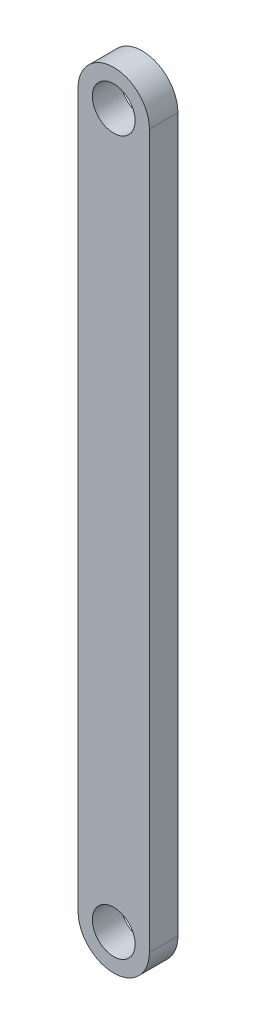
ISO-10303-21;
HEADER;
FILE_DESCRIPTION(('STEP AP214'),'2;1');
FILE_NAME('part.step','',(''),(''),'','','');
FILE_SCHEMA(('AUTOMOTIVE_DESIGN { 1 0 10303 214 1 1 1 1 }'));
ENDSEC;
DATA;
#1=APPLICATION_CONTEXT('core data for automotive mechanical design processes');
#2=APPLICATION_PROTOCOL_DEFINITION('international standard','automotive_design',2000,#1);
#3=PRODUCT_CONTEXT('',#1,'mechanical');
#4=PRODUCT('Part','Part','',(#3));
#5=PRODUCT_RELATED_PRODUCT_CATEGORY('part','',(#4));
#6=PRODUCT_DEFINITION_FORMATION('','',#4);
#7=PRODUCT_DEFINITION_CONTEXT('part definition',#1,'design');
#8=PRODUCT_DEFINITION('design','',#6,#7);
#9=PRODUCT_DEFINITION_SHAPE('','',#8);
#10=(LENGTH_UNIT() NAMED_UNIT(*) SI_UNIT(.MILLI.,.METRE.));
#11=(NAMED_UNIT(*) PLANE_ANGLE_UNIT() SI_UNIT($,.RADIAN.));
#12=(NAMED_UNIT(*) SI_UNIT($,.STERADIAN.) SOLID_ANGLE_UNIT());
#13=UNCERTAINTY_MEASURE_WITH_UNIT(LENGTH_MEASURE(1.E-05),#10,'distance_accuracy_value','');
#14=(GEOMETRIC_REPRESENTATION_CONTEXT(3) GLOBAL_UNCERTAINTY_ASSIGNED_CONTEXT((#13)) GLOBAL_UNIT_ASSIGNED_CONTEXT((#10,
#11,#12)) REPRESENTATION_CONTEXT('',''));
#15=CARTESIAN_POINT('',(0.,0.,0.));
#16=DIRECTION('',(0.,0.,1.));
#17=DIRECTION('',(1.,0.,0.));
#18=AXIS2_PLACEMENT_3D('',#15,#16,#17);
#19=CARTESIAN_POINT('',(0.,50.,-2.));
#20=DIRECTION('',(0.,0.,1.));
#21=DIRECTION('',(1.,0.,0.));
#22=AXIS2_PLACEMENT_3D('',#19,#20,#21);
#23=CYLINDRICAL_SURFACE('',#22,2.5);
#24=CARTESIAN_POINT('',(0.,50.,0.));
#25=DIRECTION('',(0.,0.,1.));
#26=DIRECTION('',(1.,0.,0.));
#27=AXIS2_PLACEMENT_3D('',#24,#25,#26);
#28=CIRCLE('',#27,2.5);
#29=CARTESIAN_POINT('',(2.5,50.,0.));
#30=VERTEX_POINT('',#29);
#31=CARTESIAN_POINT('',(-2.50000000000001,50.,0.));
#32=VERTEX_POINT('',#31);
#33=EDGE_CURVE('E110',#30,#32,#28,.T.);
#34=ORIENTED_EDGE('',*,*,#33,.F.);
#35=DIRECTION('',(0.,0.,1.));
#36=VECTOR('',#35,1.);
#37=CARTESIAN_POINT('',(2.5,50.,-2.));
#38=LINE('',#37,#36);
#39=CARTESIAN_POINT('',(2.5,50.,-2.));
#40=VERTEX_POINT('',#39);
#41=EDGE_CURVE('E11',#40,#30,#38,.T.);
#42=ORIENTED_EDGE('',*,*,#41,.F.);
#43=CARTESIAN_POINT('',(0.,50.,-2.));
#44=DIRECTION('',(0.,0.,1.));
#45=DIRECTION('',(1.,0.,0.));
#46=AXIS2_PLACEMENT_3D('',#43,#44,#45);
#47=CIRCLE('',#46,2.5);
#48=CARTESIAN_POINT('',(-2.50000000000001,50.,-2.));
#49=VERTEX_POINT('',#48);
#50=EDGE_CURVE('E100',#40,#49,#47,.T.);
#51=ORIENTED_EDGE('',*,*,#50,.T.);
#52=DIRECTION('',(0.,0.,1.));
#53=VECTOR('',#52,1.);
#54=CARTESIAN_POINT('',(-2.50000000000001,50.,-2.));
#55=LINE('',#54,#53);
#56=EDGE_CURVE('E44',#49,#32,#55,.T.);
#57=ORIENTED_EDGE('',*,*,#56,.T.);
#58=EDGE_LOOP('',(#34,#42,#51,#57));
#59=FACE_BOUND('',#58,.T.);
#60=ADVANCED_FACE('F41',(#59),#23,.T.);
#61=CARTESIAN_POINT('',(2.5,0.,-2.));
#62=DIRECTION('',(-1.,0.,0.));
#63=DIRECTION('',(0.,0.,1.));
#64=AXIS2_PLACEMENT_3D('',#61,#62,#63);
#65=PLANE('',#64);
#66=DIRECTION('',(0.,-1.,0.));
#67=VECTOR('',#66,1.);
#68=CARTESIAN_POINT('',(2.5,0.,0.));
#69=LINE('',#68,#67);
#70=CARTESIAN_POINT('',(2.5,0.,0.));
#71=VERTEX_POINT('',#70);
#72=EDGE_CURVE('E120',#30,#71,#69,.T.);
#73=ORIENTED_EDGE('',*,*,#72,.T.);
#74=DIRECTION('',(0.,0.,1.));
#75=VECTOR('',#74,1.);
#76=CARTESIAN_POINT('',(2.5,0.,-2.));
#77=LINE('',#76,#75);
#78=CARTESIAN_POINT('',(2.5,0.,-2.));
#79=VERTEX_POINT('',#78);
#80=EDGE_CURVE('E51',#79,#71,#77,.T.);
#81=ORIENTED_EDGE('',*,*,#80,.F.);
#82=DIRECTION('',(0.,-1.,0.));
#83=VECTOR('',#82,1.);
#84=CARTESIAN_POINT('',(2.5,0.,-2.));
#85=LINE('',#84,#83);
#86=EDGE_CURVE('E103',#40,#79,#85,.T.);
#87=ORIENTED_EDGE('',*,*,#86,.F.);
#88=ORIENTED_EDGE('',*,*,#41,.T.);
#89=EDGE_LOOP('',(#73,#81,#87,#88));
#90=FACE_BOUND('',#89,.T.);
#91=ADVANCED_FACE('F127',(#90),#65,.F.);
#92=CARTESIAN_POINT('',(0.,0.,-2.));
#93=DIRECTION('',(0.,0.,1.));
#94=DIRECTION('',(1.,0.,0.));
#95=AXIS2_PLACEMENT_3D('',#92,#93,#94);
#96=CYLINDRICAL_SURFACE('',#95,2.5);
#97=CARTESIAN_POINT('',(0.,0.,0.));
#98=DIRECTION('',(0.,0.,1.));
#99=DIRECTION('',(1.,0.,0.));
#100=AXIS2_PLACEMENT_3D('',#97,#98,#99);
#101=CIRCLE('',#100,2.5);
#102=CARTESIAN_POINT('',(-2.5,0.,0.));
#103=VERTEX_POINT('',#102);
#104=EDGE_CURVE('E93',#103,#71,#101,.T.);
#105=ORIENTED_EDGE('',*,*,#104,.F.);
#106=DIRECTION('',(0.,0.,1.));
#107=VECTOR('',#106,1.);
#108=CARTESIAN_POINT('',(-2.5,0.,-2.));
#109=LINE('',#108,#107);
#110=CARTESIAN_POINT('',(-2.5,0.,-2.));
#111=VERTEX_POINT('',#110);
#112=EDGE_CURVE('E89',#111,#103,#109,.T.);
#113=ORIENTED_EDGE('',*,*,#112,.F.);
#114=CARTESIAN_POINT('',(0.,0.,-2.));
#115=DIRECTION('',(0.,0.,1.));
#116=DIRECTION('',(1.,0.,0.));
#117=AXIS2_PLACEMENT_3D('',#114,#115,#116);
#118=CIRCLE('',#117,2.5);
#119=EDGE_CURVE('E91',#111,#79,#118,.T.);
#120=ORIENTED_EDGE('',*,*,#119,.T.);
#121=ORIENTED_EDGE('',*,*,#80,.T.);
#122=EDGE_LOOP('',(#105,#113,#120,#121));
#123=FACE_BOUND('',#122,.T.);
#124=ADVANCED_FACE('F90',(#123),#96,.T.);
#125=CARTESIAN_POINT('',(-2.5,0.,-2.));
#126=DIRECTION('',(1.,0.,0.));
#127=DIRECTION('',(0.,1.,0.));
#128=AXIS2_PLACEMENT_3D('',#125,#126,#127);
#129=PLANE('',#128);
#130=DIRECTION('',(0.,1.,0.));
#131=VECTOR('',#130,1.);
#132=CARTESIAN_POINT('',(-2.5,0.,0.));
#133=LINE('',#132,#131);
#134=EDGE_CURVE('E114',#103,#32,#133,.T.);
#135=ORIENTED_EDGE('',*,*,#134,.T.);
#136=ORIENTED_EDGE('',*,*,#56,.F.);
#137=DIRECTION('',(0.,1.,0.));
#138=VECTOR('',#137,1.);
#139=CARTESIAN_POINT('',(-2.5,0.,-2.));
#140=LINE('',#139,#138);
#141=EDGE_CURVE('E86',#111,#49,#140,.T.);
#142=ORIENTED_EDGE('',*,*,#141,.F.);
#143=ORIENTED_EDGE('',*,*,#112,.T.);
#144=EDGE_LOOP('',(#135,#136,#142,#143));
#145=FACE_BOUND('',#144,.T.);
#146=ADVANCED_FACE('F98',(#145),#129,.F.);
#147=CARTESIAN_POINT('',(0.,0.,-2.));
#148=DIRECTION('',(0.,0.,1.));
#149=DIRECTION('',(1.,0.,0.));
#150=AXIS2_PLACEMENT_3D('',#147,#148,#149);
#151=PLANE('',#150);
#152=CARTESIAN_POINT('',(0.,50.,-2.));
#153=DIRECTION('',(0.,0.,1.));
#154=DIRECTION('',(1.,0.,0.));
#155=AXIS2_PLACEMENT_3D('',#152,#153,#154);
#156=CIRCLE('',#155,1.5);
#157=CARTESIAN_POINT('',(1.5,50.,-2.));
#158=VERTEX_POINT('',#157);
#159=EDGE_CURVE('E134',#158,#158,#156,.T.);
#160=ORIENTED_EDGE('',*,*,#159,.T.);
#161=EDGE_LOOP('',(#160));
#162=FACE_BOUND('',#161,.T.);
#163=CARTESIAN_POINT('',(0.,0.,-2.));
#164=DIRECTION('',(0.,0.,1.));
#165=DIRECTION('',(1.,0.,0.));
#166=AXIS2_PLACEMENT_3D('',#163,#164,#165);
#167=CIRCLE('',#166,1.5);
#168=CARTESIAN_POINT('',(1.5,0.,-2.));
#169=VERTEX_POINT('',#168);
#170=EDGE_CURVE('E115',#169,#169,#167,.T.);
#171=ORIENTED_EDGE('',*,*,#170,.T.);
#172=EDGE_LOOP('',(#171));
#173=FACE_BOUND('',#172,.T.);
#174=ORIENTED_EDGE('',*,*,#50,.F.);
#175=ORIENTED_EDGE('',*,*,#86,.T.);
#176=ORIENTED_EDGE('',*,*,#119,.F.);
#177=ORIENTED_EDGE('',*,*,#141,.T.);
#178=EDGE_LOOP('',(#174,#175,#176,#177));
#179=FACE_BOUND('',#178,.T.);
#180=ADVANCED_FACE('F102',(#162,#173,#179),#151,.F.);
#181=CARTESIAN_POINT('',(0.,0.,0.));
#182=DIRECTION('',(0.,0.,1.));
#183=DIRECTION('',(1.,0.,0.));
#184=AXIS2_PLACEMENT_3D('',#181,#182,#183);
#185=PLANE('',#184);
#186=CARTESIAN_POINT('',(0.,50.,0.));
#187=DIRECTION('',(0.,0.,1.));
#188=DIRECTION('',(1.,0.,0.));
#189=AXIS2_PLACEMENT_3D('',#186,#187,#188);
#190=CIRCLE('',#189,1.5);
#191=CARTESIAN_POINT('',(1.5,50.,0.));
#192=VERTEX_POINT('',#191);
#193=EDGE_CURVE('E138',#192,#192,#190,.T.);
#194=ORIENTED_EDGE('',*,*,#193,.F.);
#195=EDGE_LOOP('',(#194));
#196=FACE_BOUND('',#195,.T.);
#197=CARTESIAN_POINT('',(0.,0.,0.));
#198=DIRECTION('',(0.,0.,1.));
#199=DIRECTION('',(1.,0.,0.));
#200=AXIS2_PLACEMENT_3D('',#197,#198,#199);
#201=CIRCLE('',#200,1.5);
#202=CARTESIAN_POINT('',(1.5,0.,0.));
#203=VERTEX_POINT('',#202);
#204=EDGE_CURVE('E130',#203,#203,#201,.T.);
#205=ORIENTED_EDGE('',*,*,#204,.F.);
#206=EDGE_LOOP('',(#205));
#207=FACE_BOUND('',#206,.T.);
#208=ORIENTED_EDGE('',*,*,#33,.T.);
#209=ORIENTED_EDGE('',*,*,#134,.F.);
#210=ORIENTED_EDGE('',*,*,#104,.T.);
#211=ORIENTED_EDGE('',*,*,#72,.F.);
#212=EDGE_LOOP('',(#208,#209,#210,#211));
#213=FACE_BOUND('',#212,.T.);
#214=ADVANCED_FACE('F126',(#196,#207,#213),#185,.T.);
#215=CARTESIAN_POINT('',(0.,0.,-2.));
#216=DIRECTION('',(0.,0.,1.));
#217=DIRECTION('',(1.,0.,0.));
#218=AXIS2_PLACEMENT_3D('',#215,#216,#217);
#219=CYLINDRICAL_SURFACE('',#218,1.5);
#220=ORIENTED_EDGE('',*,*,#170,.F.);
#221=EDGE_LOOP('',(#220));
#222=FACE_BOUND('',#221,.T.);
#223=ORIENTED_EDGE('',*,*,#204,.T.);
#224=EDGE_LOOP('',(#223));
#225=FACE_BOUND('',#224,.T.);
#226=ADVANCED_FACE('F151',(#222,#225),#219,.F.);
#227=CARTESIAN_POINT('',(0.,50.,-2.));
#228=DIRECTION('',(0.,0.,1.));
#229=DIRECTION('',(1.,0.,0.));
#230=AXIS2_PLACEMENT_3D('',#227,#228,#229);
#231=CYLINDRICAL_SURFACE('',#230,1.5);
#232=ORIENTED_EDGE('',*,*,#159,.F.);
#233=EDGE_LOOP('',(#232));
#234=FACE_BOUND('',#233,.T.);
#235=ORIENTED_EDGE('',*,*,#193,.T.);
#236=EDGE_LOOP('',(#235));
#237=FACE_BOUND('',#236,.T.);
#238=ADVANCED_FACE('F148',(#234,#237),#231,.F.);
#239=CLOSED_SHELL('',(#60,#91,#124,#146,#180,#214,#226,#238));
#240=MANIFOLD_SOLID_BREP('B2',#239);
#241=ADVANCED_BREP_SHAPE_REPRESENTATION('',(#18,#240),#14);
#242=SHAPE_DEFINITION_REPRESENTATION(#9,#241);
ENDSEC;
END-ISO-10303-21;
